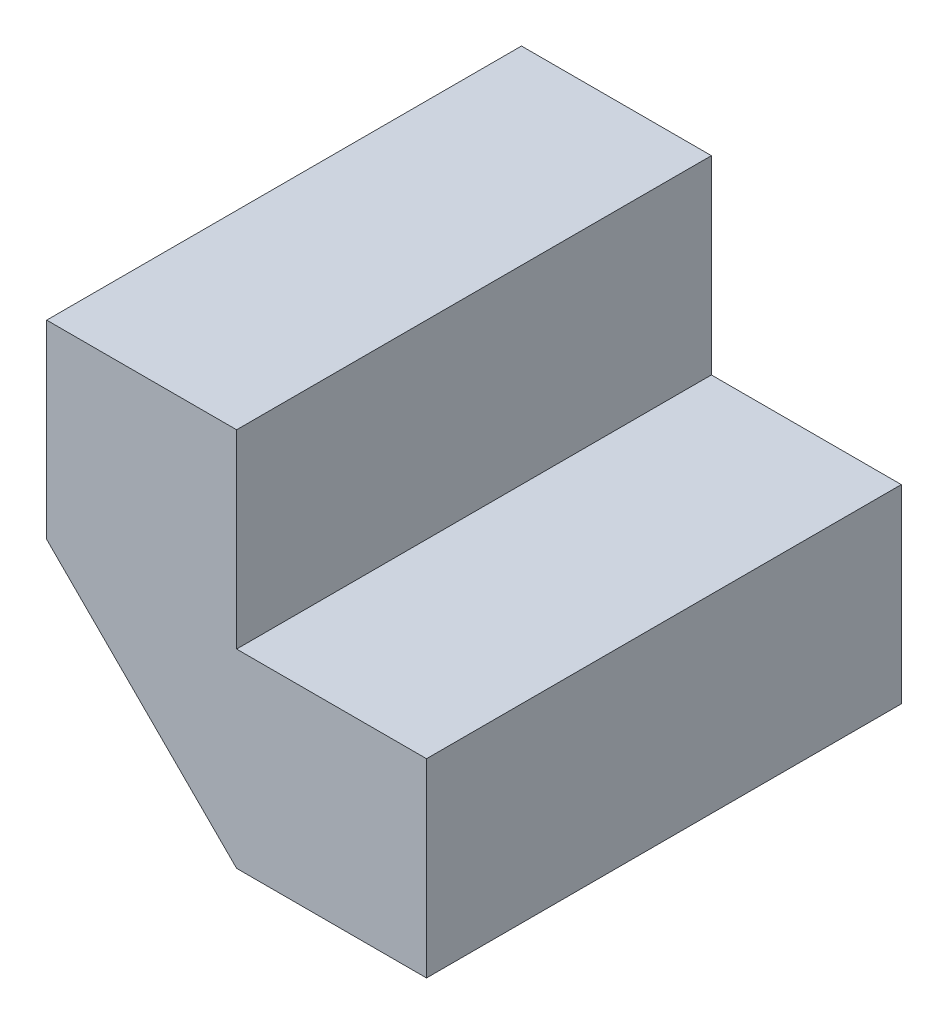
ISO-10303-21;
HEADER;
FILE_DESCRIPTION(('STEP AP214'),'2;1');
FILE_NAME('part.step','',(''),(''),'','','');
FILE_SCHEMA(('AUTOMOTIVE_DESIGN { 1 0 10303 214 1 1 1 1 }'));
ENDSEC;
DATA;
#1=APPLICATION_CONTEXT('core data for automotive mechanical design processes');
#2=APPLICATION_PROTOCOL_DEFINITION('international standard','automotive_design',2000,#1);
#3=PRODUCT_CONTEXT('',#1,'mechanical');
#4=PRODUCT('Part','Part','',(#3));
#5=PRODUCT_RELATED_PRODUCT_CATEGORY('part','',(#4));
#6=PRODUCT_DEFINITION_FORMATION('','',#4);
#7=PRODUCT_DEFINITION_CONTEXT('part definition',#1,'design');
#8=PRODUCT_DEFINITION('design','',#6,#7);
#9=PRODUCT_DEFINITION_SHAPE('','',#8);
#10=(LENGTH_UNIT() NAMED_UNIT(*) SI_UNIT(.MILLI.,.METRE.));
#11=(NAMED_UNIT(*) PLANE_ANGLE_UNIT() SI_UNIT($,.RADIAN.));
#12=(NAMED_UNIT(*) SI_UNIT($,.STERADIAN.) SOLID_ANGLE_UNIT());
#13=UNCERTAINTY_MEASURE_WITH_UNIT(LENGTH_MEASURE(1.E-05),#10,'distance_accuracy_value','');
#14=(GEOMETRIC_REPRESENTATION_CONTEXT(3) GLOBAL_UNCERTAINTY_ASSIGNED_CONTEXT((#13)) GLOBAL_UNIT_ASSIGNED_CONTEXT((#10,
#11,#12)) REPRESENTATION_CONTEXT('',''));
#15=CARTESIAN_POINT('',(0.,0.,0.));
#16=DIRECTION('',(0.,0.,1.));
#17=DIRECTION('',(1.,0.,0.));
#18=AXIS2_PLACEMENT_3D('',#15,#16,#17);
#19=CARTESIAN_POINT('',(-20.,10.,25.));
#20=DIRECTION('',(1.,0.,0.));
#21=DIRECTION('',(0.,0.,-1.));
#22=AXIS2_PLACEMENT_3D('',#19,#20,#21);
#23=PLANE('',#22);
#24=DIRECTION('',(0.,-1.,0.));
#25=VECTOR('',#24,1.);
#26=CARTESIAN_POINT('',(-20.,10.,0.));
#27=LINE('',#26,#25);
#28=CARTESIAN_POINT('',(-20.,20.,0.));
#29=VERTEX_POINT('',#28);
#30=CARTESIAN_POINT('',(-20.,10.,0.));
#31=VERTEX_POINT('',#30);
#32=EDGE_CURVE('E123',#29,#31,#27,.T.);
#33=ORIENTED_EDGE('',*,*,#32,.T.);
#34=DIRECTION('',(0.,0.,-1.));
#35=VECTOR('',#34,1.);
#36=CARTESIAN_POINT('',(-20.,10.,25.));
#37=LINE('',#36,#35);
#38=CARTESIAN_POINT('',(-20.,10.,25.));
#39=VERTEX_POINT('',#38);
#40=EDGE_CURVE('E11',#39,#31,#37,.T.);
#41=ORIENTED_EDGE('',*,*,#40,.F.);
#42=DIRECTION('',(0.,-1.,0.));
#43=VECTOR('',#42,1.);
#44=CARTESIAN_POINT('',(-20.,10.,25.));
#45=LINE('',#44,#43);
#46=CARTESIAN_POINT('',(-20.,20.,25.));
#47=VERTEX_POINT('',#46);
#48=EDGE_CURVE('E135',#47,#39,#45,.T.);
#49=ORIENTED_EDGE('',*,*,#48,.F.);
#50=DIRECTION('',(0.,0.,-1.));
#51=VECTOR('',#50,1.);
#52=CARTESIAN_POINT('',(-20.,20.,25.));
#53=LINE('',#52,#51);
#54=EDGE_CURVE('E119',#47,#29,#53,.T.);
#55=ORIENTED_EDGE('',*,*,#54,.T.);
#56=EDGE_LOOP('',(#33,#41,#49,#55));
#57=FACE_BOUND('',#56,.T.);
#58=ADVANCED_FACE('F33',(#57),#23,.F.);
#59=CARTESIAN_POINT('',(-10.,0.,25.));
#60=DIRECTION('',(0.707106781186548,0.707106781186548,0.));
#61=DIRECTION('',(-0.707106781186548,0.707106781186548,0.));
#62=AXIS2_PLACEMENT_3D('',#59,#60,#61);
#63=PLANE('',#62);
#64=DIRECTION('',(0.707106781186548,-0.707106781186548,0.));
#65=VECTOR('',#64,1.);
#66=CARTESIAN_POINT('',(-10.,0.,0.));
#67=LINE('',#66,#65);
#68=CARTESIAN_POINT('',(-10.,0.,0.));
#69=VERTEX_POINT('',#68);
#70=EDGE_CURVE('E126',#31,#69,#67,.T.);
#71=ORIENTED_EDGE('',*,*,#70,.T.);
#72=DIRECTION('',(0.,0.,-1.));
#73=VECTOR('',#72,1.);
#74=CARTESIAN_POINT('',(-10.,0.,25.));
#75=LINE('',#74,#73);
#76=CARTESIAN_POINT('',(-10.,0.,25.));
#77=VERTEX_POINT('',#76);
#78=EDGE_CURVE('E41',#77,#69,#75,.T.);
#79=ORIENTED_EDGE('',*,*,#78,.F.);
#80=DIRECTION('',(0.707106781186548,-0.707106781186548,0.));
#81=VECTOR('',#80,1.);
#82=CARTESIAN_POINT('',(-10.,0.,25.));
#83=LINE('',#82,#81);
#84=EDGE_CURVE('E89',#39,#77,#83,.T.);
#85=ORIENTED_EDGE('',*,*,#84,.F.);
#86=ORIENTED_EDGE('',*,*,#40,.T.);
#87=EDGE_LOOP('',(#71,#79,#85,#86));
#88=FACE_BOUND('',#87,.T.);
#89=ADVANCED_FACE('F160',(#88),#63,.F.);
#90=CARTESIAN_POINT('',(0.,0.,25.));
#91=DIRECTION('',(0.,1.,0.));
#92=DIRECTION('',(-1.,0.,0.));
#93=AXIS2_PLACEMENT_3D('',#90,#91,#92);
#94=PLANE('',#93);
#95=DIRECTION('',(1.,0.,0.));
#96=VECTOR('',#95,1.);
#97=CARTESIAN_POINT('',(0.,0.,0.));
#98=LINE('',#97,#96);
#99=CARTESIAN_POINT('',(0.,0.,0.));
#100=VERTEX_POINT('',#99);
#101=EDGE_CURVE('E128',#69,#100,#98,.T.);
#102=ORIENTED_EDGE('',*,*,#101,.T.);
#103=DIRECTION('',(0.,0.,-1.));
#104=VECTOR('',#103,1.);
#105=CARTESIAN_POINT('',(0.,0.,25.));
#106=LINE('',#105,#104);
#107=CARTESIAN_POINT('',(0.,0.,25.));
#108=VERTEX_POINT('',#107);
#109=EDGE_CURVE('E139',#108,#100,#106,.T.);
#110=ORIENTED_EDGE('',*,*,#109,.F.);
#111=DIRECTION('',(1.,0.,0.));
#112=VECTOR('',#111,1.);
#113=CARTESIAN_POINT('',(0.,0.,25.));
#114=LINE('',#113,#112);
#115=EDGE_CURVE('E147',#77,#108,#114,.T.);
#116=ORIENTED_EDGE('',*,*,#115,.F.);
#117=ORIENTED_EDGE('',*,*,#78,.T.);
#118=EDGE_LOOP('',(#102,#110,#116,#117));
#119=FACE_BOUND('',#118,.T.);
#120=ADVANCED_FACE('F145',(#119),#94,.F.);
#121=CARTESIAN_POINT('',(0.,10.,25.));
#122=DIRECTION('',(-1.,0.,0.));
#123=DIRECTION('',(0.,0.,1.));
#124=AXIS2_PLACEMENT_3D('',#121,#122,#123);
#125=PLANE('',#124);
#126=DIRECTION('',(0.,1.,0.));
#127=VECTOR('',#126,1.);
#128=CARTESIAN_POINT('',(0.,10.,0.));
#129=LINE('',#128,#127);
#130=CARTESIAN_POINT('',(0.,10.,0.));
#131=VERTEX_POINT('',#130);
#132=EDGE_CURVE('E130',#100,#131,#129,.T.);
#133=ORIENTED_EDGE('',*,*,#132,.T.);
#134=DIRECTION('',(0.,0.,-1.));
#135=VECTOR('',#134,1.);
#136=CARTESIAN_POINT('',(0.,10.,25.));
#137=LINE('',#136,#135);
#138=CARTESIAN_POINT('',(0.,10.,25.));
#139=VERTEX_POINT('',#138);
#140=EDGE_CURVE('E114',#139,#131,#137,.T.);
#141=ORIENTED_EDGE('',*,*,#140,.F.);
#142=DIRECTION('',(0.,1.,0.));
#143=VECTOR('',#142,1.);
#144=CARTESIAN_POINT('',(0.,10.,25.));
#145=LINE('',#144,#143);
#146=EDGE_CURVE('E105',#108,#139,#145,.T.);
#147=ORIENTED_EDGE('',*,*,#146,.F.);
#148=ORIENTED_EDGE('',*,*,#109,.T.);
#149=EDGE_LOOP('',(#133,#141,#147,#148));
#150=FACE_BOUND('',#149,.T.);
#151=ADVANCED_FACE('F153',(#150),#125,.F.);
#152=CARTESIAN_POINT('',(-10.,10.,25.));
#153=DIRECTION('',(0.,-1.,0.));
#154=DIRECTION('',(1.,0.,0.));
#155=AXIS2_PLACEMENT_3D('',#152,#153,#154);
#156=PLANE('',#155);
#157=DIRECTION('',(-1.,0.,0.));
#158=VECTOR('',#157,1.);
#159=CARTESIAN_POINT('',(-10.,10.,0.));
#160=LINE('',#159,#158);
#161=CARTESIAN_POINT('',(-10.,10.,0.));
#162=VERTEX_POINT('',#161);
#163=EDGE_CURVE('E113',#131,#162,#160,.T.);
#164=ORIENTED_EDGE('',*,*,#163,.T.);
#165=DIRECTION('',(0.,0.,-1.));
#166=VECTOR('',#165,1.);
#167=CARTESIAN_POINT('',(-10.,10.,25.));
#168=LINE('',#167,#166);
#169=CARTESIAN_POINT('',(-10.,10.,25.));
#170=VERTEX_POINT('',#169);
#171=EDGE_CURVE('E110',#170,#162,#168,.T.);
#172=ORIENTED_EDGE('',*,*,#171,.F.);
#173=DIRECTION('',(-1.,0.,0.));
#174=VECTOR('',#173,1.);
#175=CARTESIAN_POINT('',(-10.,10.,25.));
#176=LINE('',#175,#174);
#177=EDGE_CURVE('E99',#139,#170,#176,.T.);
#178=ORIENTED_EDGE('',*,*,#177,.F.);
#179=ORIENTED_EDGE('',*,*,#140,.T.);
#180=EDGE_LOOP('',(#164,#172,#178,#179));
#181=FACE_BOUND('',#180,.T.);
#182=ADVANCED_FACE('F111',(#181),#156,.F.);
#183=CARTESIAN_POINT('',(-10.,20.,25.));
#184=DIRECTION('',(-1.,0.,0.));
#185=DIRECTION('',(0.,0.,1.));
#186=AXIS2_PLACEMENT_3D('',#183,#184,#185);
#187=PLANE('',#186);
#188=DIRECTION('',(0.,1.,0.));
#189=VECTOR('',#188,1.);
#190=CARTESIAN_POINT('',(-10.,20.,0.));
#191=LINE('',#190,#189);
#192=CARTESIAN_POINT('',(-10.,20.,0.));
#193=VERTEX_POINT('',#192);
#194=EDGE_CURVE('E75',#162,#193,#191,.T.);
#195=ORIENTED_EDGE('',*,*,#194,.T.);
#196=DIRECTION('',(0.,0.,-1.));
#197=VECTOR('',#196,1.);
#198=CARTESIAN_POINT('',(-10.,20.,25.));
#199=LINE('',#198,#197);
#200=CARTESIAN_POINT('',(-10.,20.,25.));
#201=VERTEX_POINT('',#200);
#202=EDGE_CURVE('E115',#201,#193,#199,.T.);
#203=ORIENTED_EDGE('',*,*,#202,.F.);
#204=DIRECTION('',(0.,1.,0.));
#205=VECTOR('',#204,1.);
#206=CARTESIAN_POINT('',(-10.,20.,25.));
#207=LINE('',#206,#205);
#208=EDGE_CURVE('E103',#170,#201,#207,.T.);
#209=ORIENTED_EDGE('',*,*,#208,.F.);
#210=ORIENTED_EDGE('',*,*,#171,.T.);
#211=EDGE_LOOP('',(#195,#203,#209,#210));
#212=FACE_BOUND('',#211,.T.);
#213=ADVANCED_FACE('F117',(#212),#187,.F.);
#214=CARTESIAN_POINT('',(-20.,20.,25.));
#215=DIRECTION('',(0.,-1.,0.));
#216=DIRECTION('',(0.,0.,-1.));
#217=AXIS2_PLACEMENT_3D('',#214,#215,#216);
#218=PLANE('',#217);
#219=DIRECTION('',(-1.,0.,0.));
#220=VECTOR('',#219,1.);
#221=CARTESIAN_POINT('',(-20.,20.,0.));
#222=LINE('',#221,#220);
#223=EDGE_CURVE('E81',#193,#29,#222,.T.);
#224=ORIENTED_EDGE('',*,*,#223,.T.);
#225=ORIENTED_EDGE('',*,*,#54,.F.);
#226=DIRECTION('',(-1.,0.,0.));
#227=VECTOR('',#226,1.);
#228=CARTESIAN_POINT('',(-20.,20.,25.));
#229=LINE('',#228,#227);
#230=EDGE_CURVE('E49',#201,#47,#229,.T.);
#231=ORIENTED_EDGE('',*,*,#230,.F.);
#232=ORIENTED_EDGE('',*,*,#202,.T.);
#233=EDGE_LOOP('',(#224,#225,#231,#232));
#234=FACE_BOUND('',#233,.T.);
#235=ADVANCED_FACE('F174',(#234),#218,.F.);
#236=CARTESIAN_POINT('',(0.,0.,25.));
#237=DIRECTION('',(0.,0.,-1.));
#238=DIRECTION('',(-1.,0.,0.));
#239=AXIS2_PLACEMENT_3D('',#236,#237,#238);
#240=PLANE('',#239);
#241=ORIENTED_EDGE('',*,*,#48,.T.);
#242=ORIENTED_EDGE('',*,*,#84,.T.);
#243=ORIENTED_EDGE('',*,*,#115,.T.);
#244=ORIENTED_EDGE('',*,*,#146,.T.);
#245=ORIENTED_EDGE('',*,*,#177,.T.);
#246=ORIENTED_EDGE('',*,*,#208,.T.);
#247=ORIENTED_EDGE('',*,*,#230,.T.);
#248=EDGE_LOOP('',(#241,#242,#243,#244,#245,#246,#247));
#249=FACE_BOUND('',#248,.T.);
#250=ADVANCED_FACE('F101',(#249),#240,.F.);
#251=CARTESIAN_POINT('',(0.,0.,0.));
#252=DIRECTION('',(0.,0.,-1.));
#253=DIRECTION('',(-1.,0.,0.));
#254=AXIS2_PLACEMENT_3D('',#251,#252,#253);
#255=PLANE('',#254);
#256=ORIENTED_EDGE('',*,*,#32,.F.);
#257=ORIENTED_EDGE('',*,*,#223,.F.);
#258=ORIENTED_EDGE('',*,*,#194,.F.);
#259=ORIENTED_EDGE('',*,*,#163,.F.);
#260=ORIENTED_EDGE('',*,*,#132,.F.);
#261=ORIENTED_EDGE('',*,*,#101,.F.);
#262=ORIENTED_EDGE('',*,*,#70,.F.);
#263=EDGE_LOOP('',(#256,#257,#258,#259,#260,#261,#262));
#264=FACE_BOUND('',#263,.T.);
#265=ADVANCED_FACE('F151',(#264),#255,.T.);
#266=CLOSED_SHELL('',(#58,#89,#120,#151,#182,#213,#235,#250,#265));
#267=MANIFOLD_SOLID_BREP('B2',#266);
#268=ADVANCED_BREP_SHAPE_REPRESENTATION('',(#18,#267),#14);
#269=SHAPE_DEFINITION_REPRESENTATION(#9,#268);
ENDSEC;
END-ISO-10303-21;
